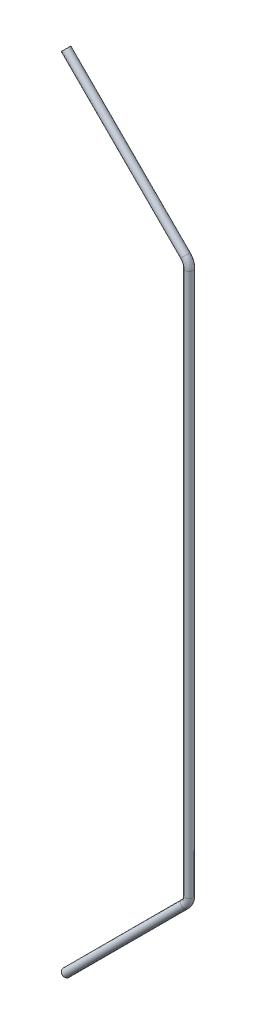
ISO-10303-21;
HEADER;
FILE_DESCRIPTION(('STEP AP214'),'2;1');
FILE_NAME('part.step','',(''),(''),'','','');
FILE_SCHEMA(('AUTOMOTIVE_DESIGN { 1 0 10303 214 1 1 1 1 }'));
ENDSEC;
DATA;
#1=APPLICATION_CONTEXT('core data for automotive mechanical design processes');
#2=APPLICATION_PROTOCOL_DEFINITION('international standard','automotive_design',2000,#1);
#3=PRODUCT_CONTEXT('',#1,'mechanical');
#4=PRODUCT('Part','Part','',(#3));
#5=PRODUCT_RELATED_PRODUCT_CATEGORY('part','',(#4));
#6=PRODUCT_DEFINITION_FORMATION('','',#4);
#7=PRODUCT_DEFINITION_CONTEXT('part definition',#1,'design');
#8=PRODUCT_DEFINITION('design','',#6,#7);
#9=PRODUCT_DEFINITION_SHAPE('','',#8);
#10=(LENGTH_UNIT() NAMED_UNIT(*) SI_UNIT(.MILLI.,.METRE.));
#11=(NAMED_UNIT(*) PLANE_ANGLE_UNIT() SI_UNIT($,.RADIAN.));
#12=(NAMED_UNIT(*) SI_UNIT($,.STERADIAN.) SOLID_ANGLE_UNIT());
#13=UNCERTAINTY_MEASURE_WITH_UNIT(LENGTH_MEASURE(1.E-05),#10,'distance_accuracy_value','');
#14=(GEOMETRIC_REPRESENTATION_CONTEXT(3) GLOBAL_UNCERTAINTY_ASSIGNED_CONTEXT((#13)) GLOBAL_UNIT_ASSIGNED_CONTEXT((#10,
#11,#12)) REPRESENTATION_CONTEXT('',''));
#15=CARTESIAN_POINT('',(0.,0.,0.));
#16=DIRECTION('',(0.,0.,1.));
#17=DIRECTION('',(1.,0.,0.));
#18=AXIS2_PLACEMENT_3D('',#15,#16,#17);
#19=CARTESIAN_POINT('',(-23026.9467766004,7669.40648306194,40306.6001960676));
#20=DIRECTION('',(0.707106781186548,-0.707106781186547,0.));
#21=DIRECTION('',(0.707106781186547,0.707106781186548,0.));
#22=AXIS2_PLACEMENT_3D('',#19,#20,#21);
#23=PLANE('',#22);
#24=CARTESIAN_POINT('',(-23026.9467766004,7669.40648306194,40306.6001960676));
#25=DIRECTION('',(0.707106781186548,-0.707106781186547,0.));
#26=DIRECTION('',(0.707106781186547,0.707106781186548,0.));
#27=AXIS2_PLACEMENT_3D('',#24,#25,#26);
#28=CIRCLE('',#27,27.0000000000004);
#29=CARTESIAN_POINT('',(-23007.8548935084,7688.49836615398,40306.6001960676));
#30=VERTEX_POINT('',#29);
#31=EDGE_CURVE('E76',#30,#30,#28,.T.);
#32=ORIENTED_EDGE('',*,*,#31,.T.);
#33=EDGE_LOOP('',(#32));
#34=FACE_BOUND('',#33,.T.);
#35=CARTESIAN_POINT('',(-23026.9467766004,7669.40648306194,40306.6001960676));
#36=DIRECTION('',(0.707106781186548,-0.707106781186547,0.));
#37=DIRECTION('',(0.707106781186547,0.707106781186548,0.));
#38=AXIS2_PLACEMENT_3D('',#35,#36,#37);
#39=CIRCLE('',#38,30.0000000000004);
#40=CARTESIAN_POINT('',(-23005.7335731648,7690.61968649754,40306.6001960676));
#41=VERTEX_POINT('',#40);
#42=EDGE_CURVE('E69',#41,#41,#39,.T.);
#43=ORIENTED_EDGE('',*,*,#42,.F.);
#44=EDGE_LOOP('',(#43));
#45=FACE_BOUND('',#44,.T.);
#46=ADVANCED_FACE('F47',(#34,#45),#23,.F.);
#47=CARTESIAN_POINT('',(-23026.9467766004,1498.91898498165,40306.6001960676));
#48=DIRECTION('',(-0.707106781186545,-0.70710678118655,0.));
#49=DIRECTION('',(0.70710678118655,-0.707106781186545,0.));
#50=AXIS2_PLACEMENT_3D('',#47,#48,#49);
#51=PLANE('',#50);
#52=CARTESIAN_POINT('',(-23026.9467766004,1498.91898498165,40306.6001960676));
#53=DIRECTION('',(-0.707106781186545,-0.70710678118655,0.));
#54=DIRECTION('',(0.70710678118655,-0.707106781186545,0.));
#55=AXIS2_PLACEMENT_3D('',#52,#53,#54);
#56=CIRCLE('',#55,27.0000000000004);
#57=CARTESIAN_POINT('',(-23007.8548935084,1479.82710188961,40306.6001960676));
#58=VERTEX_POINT('',#57);
#59=EDGE_CURVE('E72',#58,#58,#56,.T.);
#60=ORIENTED_EDGE('',*,*,#59,.F.);
#61=EDGE_LOOP('',(#60));
#62=FACE_BOUND('',#61,.T.);
#63=CARTESIAN_POINT('',(-23026.9467766004,1498.91898498165,40306.6001960676));
#64=DIRECTION('',(-0.707106781186545,-0.70710678118655,0.));
#65=DIRECTION('',(0.70710678118655,-0.707106781186545,0.));
#66=AXIS2_PLACEMENT_3D('',#63,#64,#65);
#67=CIRCLE('',#66,30.0000000000004);
#68=CARTESIAN_POINT('',(-23005.7335731648,1477.70578154605,40306.6001960676));
#69=VERTEX_POINT('',#68);
#70=EDGE_CURVE('E11',#69,#69,#67,.T.);
#71=ORIENTED_EDGE('',*,*,#70,.T.);
#72=EDGE_LOOP('',(#71));
#73=FACE_BOUND('',#72,.T.);
#74=ADVANCED_FACE('F119',(#62,#73),#51,.T.);
#75=CARTESIAN_POINT('',(-23026.9467766004,7669.40648306194,40306.6001960676));
#76=DIRECTION('',(0.707106781186546,-0.707106781186549,0.));
#77=DIRECTION('',(0.707106781186549,0.707106781186546,0.));
#78=AXIS2_PLACEMENT_3D('',#75,#76,#77);
#79=CYLINDRICAL_SURFACE('',#78,30.0000000000004);
#80=CARTESIAN_POINT('',(-22106.7356527818,6749.19535924333,40306.6001960676));
#81=DIRECTION('',(0.707106781186548,-0.707106781186547,0.));
#82=DIRECTION('',(0.707106781186547,0.707106781186548,0.));
#83=AXIS2_PLACEMENT_3D('',#80,#81,#82);
#84=CIRCLE('',#83,30.0000000000004);
#85=CARTESIAN_POINT('',(-22085.5224493462,6770.40856267895,40306.6001960676));
#86=VERTEX_POINT('',#85);
#87=EDGE_CURVE('E66',#86,#86,#84,.T.);
#88=ORIENTED_EDGE('',*,*,#87,.F.);
#89=EDGE_LOOP('',(#88));
#90=FACE_BOUND('',#89,.T.);
#91=ORIENTED_EDGE('',*,*,#42,.T.);
#92=EDGE_LOOP('',(#91));
#93=FACE_BOUND('',#92,.T.);
#94=ADVANCED_FACE('F121',(#90,#93),#79,.T.);
#95=CARTESIAN_POINT('',(-22177.4463309005,6678.48468112467,40306.6001960676));
#96=DIRECTION('',(0.,0.,-1.));
#97=DIRECTION('',(-1.,0.,0.));
#98=AXIS2_PLACEMENT_3D('',#95,#96,#97);
#99=TOROIDAL_SURFACE('',#98,100.000000000033,30.0000000000004);
#100=CARTESIAN_POINT('',(-22077.4463309005,6678.48468112467,40306.6001960676));
#101=DIRECTION('',(0.,-1.,0.));
#102=DIRECTION('',(1.,0.,0.));
#103=AXIS2_PLACEMENT_3D('',#100,#101,#102);
#104=CIRCLE('',#103,30.0000000000004);
#105=CARTESIAN_POINT('',(-22047.4463309004,6678.48468112468,40306.6001960676));
#106=VERTEX_POINT('',#105);
#107=EDGE_CURVE('E61',#106,#106,#104,.T.);
#108=CARTESIAN_POINT('',(-22177.4463309005,6678.48468112467,40306.6001960676));
#109=DIRECTION('',(0.,0.,-1.));
#110=DIRECTION('',(-1.,0.,0.));
#111=AXIS2_PLACEMENT_3D('',#108,#109,#110);
#112=CIRCLE('',#111,130.000000000034);
#113=EDGE_CURVE('',#86,#106,#112,.T.);
#114=ORIENTED_EDGE('',*,*,#87,.T.);
#115=ORIENTED_EDGE('',*,*,#107,.F.);
#116=ORIENTED_EDGE('',*,*,#113,.T.);
#117=ORIENTED_EDGE('',*,*,#113,.F.);
#118=EDGE_LOOP('',(#114,#116,#115,#117));
#119=FACE_BOUND('',#118,.T.);
#120=ADVANCED_FACE('F127',(#119),#99,.T.);
#121=CARTESIAN_POINT('',(-22077.4463309005,6678.48468112467,40306.6001960676));
#122=DIRECTION('',(0.,-1.,0.));
#123=DIRECTION('',(0.,0.,-1.));
#124=AXIS2_PLACEMENT_3D('',#121,#122,#123);
#125=CYLINDRICAL_SURFACE('',#124,30.0000000000004);
#126=CARTESIAN_POINT('',(-22077.4463309005,2489.84078691892,40306.6001960676));
#127=DIRECTION('',(0.,-1.,0.));
#128=DIRECTION('',(1.,0.,0.));
#129=AXIS2_PLACEMENT_3D('',#126,#127,#128);
#130=CIRCLE('',#129,30.0000000000004);
#131=CARTESIAN_POINT('',(-22047.4463309005,2489.84078691892,40306.6001960676));
#132=VERTEX_POINT('',#131);
#133=EDGE_CURVE('E57',#132,#132,#130,.T.);
#134=ORIENTED_EDGE('',*,*,#133,.F.);
#135=EDGE_LOOP('',(#134));
#136=FACE_BOUND('',#135,.T.);
#137=ORIENTED_EDGE('',*,*,#107,.T.);
#138=EDGE_LOOP('',(#137));
#139=FACE_BOUND('',#138,.T.);
#140=ADVANCED_FACE('F115',(#136,#139),#125,.T.);
#141=CARTESIAN_POINT('',(-22177.4463309005,2489.84078691891,40306.6001960676));
#142=DIRECTION('',(0.,0.,-1.));
#143=DIRECTION('',(-1.,0.,0.));
#144=AXIS2_PLACEMENT_3D('',#141,#142,#143);
#145=TOROIDAL_SURFACE('',#144,100.000000000005,30.0000000000004);
#146=CARTESIAN_POINT('',(-22106.7356527818,2419.13010880026,40306.6001960676));
#147=DIRECTION('',(-0.707106781186538,-0.707106781186558,0.));
#148=DIRECTION('',(0.707106781186558,-0.707106781186537,0.));
#149=AXIS2_PLACEMENT_3D('',#146,#147,#148);
#150=CIRCLE('',#149,30.0000000000004);
#151=CARTESIAN_POINT('',(-22085.5224493462,2397.91690536466,40306.6001960676));
#152=VERTEX_POINT('',#151);
#153=EDGE_CURVE('E53',#152,#152,#150,.T.);
#154=CARTESIAN_POINT('',(-22177.4463309005,2489.84078691891,40306.6001960676));
#155=DIRECTION('',(0.,0.,-1.));
#156=DIRECTION('',(-1.,0.,0.));
#157=AXIS2_PLACEMENT_3D('',#154,#155,#156);
#158=CIRCLE('',#157,130.000000000005);
#159=EDGE_CURVE('',#132,#152,#158,.T.);
#160=ORIENTED_EDGE('',*,*,#133,.T.);
#161=ORIENTED_EDGE('',*,*,#153,.F.);
#162=ORIENTED_EDGE('',*,*,#159,.T.);
#163=ORIENTED_EDGE('',*,*,#159,.F.);
#164=EDGE_LOOP('',(#160,#162,#161,#163));
#165=FACE_BOUND('',#164,.T.);
#166=ADVANCED_FACE('F109',(#165),#145,.T.);
#167=CARTESIAN_POINT('',(-22106.7356527818,2419.13010880026,40306.6001960676));
#168=DIRECTION('',(-0.707106781186546,-0.707106781186549,0.));
#169=DIRECTION('',(0.707106781186549,-0.707106781186546,0.));
#170=AXIS2_PLACEMENT_3D('',#167,#168,#169);
#171=CYLINDRICAL_SURFACE('',#170,30.0000000000004);
#172=ORIENTED_EDGE('',*,*,#70,.F.);
#173=EDGE_LOOP('',(#172));
#174=FACE_BOUND('',#173,.T.);
#175=ORIENTED_EDGE('',*,*,#153,.T.);
#176=EDGE_LOOP('',(#175));
#177=FACE_BOUND('',#176,.T.);
#178=ADVANCED_FACE('F106',(#174,#177),#171,.T.);
#179=CARTESIAN_POINT('',(-23026.9467766004,7669.40648306194,40306.6001960676));
#180=DIRECTION('',(0.707106781186546,-0.707106781186549,0.));
#181=DIRECTION('',(0.707106781186549,0.707106781186546,0.));
#182=AXIS2_PLACEMENT_3D('',#179,#180,#181);
#183=CYLINDRICAL_SURFACE('',#182,27.0000000000004);
#184=CARTESIAN_POINT('',(-22106.7356527818,6749.19535924335,40306.6001960676));
#185=DIRECTION('',(-0.707106781186566,0.707106781186529,0.));
#186=DIRECTION('',(-0.707106781186529,-0.707106781186566,0.));
#187=AXIS2_PLACEMENT_3D('',#184,#185,#186);
#188=CIRCLE('',#187,27.0000000000004);
#189=CARTESIAN_POINT('',(-22087.6437696898,6768.28724233539,40306.6001960676));
#190=VERTEX_POINT('',#189);
#191=EDGE_CURVE('E79',#190,#190,#188,.F.);
#192=ORIENTED_EDGE('',*,*,#191,.T.);
#193=EDGE_LOOP('',(#192));
#194=FACE_BOUND('',#193,.T.);
#195=ORIENTED_EDGE('',*,*,#31,.F.);
#196=EDGE_LOOP('',(#195));
#197=FACE_BOUND('',#196,.T.);
#198=ADVANCED_FACE('F91',(#194,#197),#183,.F.);
#199=CARTESIAN_POINT('',(-22177.4463309005,6678.48468112467,40306.6001960676));
#200=DIRECTION('',(0.,0.,-1.));
#201=DIRECTION('',(-1.,0.,0.));
#202=AXIS2_PLACEMENT_3D('',#199,#200,#201);
#203=TOROIDAL_SURFACE('',#202,100.000000000033,27.0000000000004);
#204=CARTESIAN_POINT('',(-22077.4463309005,6678.48468112467,40306.6001960676));
#205=DIRECTION('',(0.,-1.,0.));
#206=DIRECTION('',(0.,0.,-1.));
#207=AXIS2_PLACEMENT_3D('',#204,#205,#206);
#208=CIRCLE('',#207,27.0000000000004);
#209=CARTESIAN_POINT('',(-22050.4463309004,6678.48468112468,40306.6001960676));
#210=VERTEX_POINT('',#209);
#211=EDGE_CURVE('E85',#210,#210,#208,.T.);
#212=CARTESIAN_POINT('',(-22177.4463309005,6678.48468112467,40306.6001960676));
#213=DIRECTION('',(0.,0.,-1.));
#214=DIRECTION('',(-1.,0.,0.));
#215=AXIS2_PLACEMENT_3D('',#212,#213,#214);
#216=CIRCLE('',#215,127.000000000034);
#217=EDGE_CURVE('',#190,#210,#216,.T.);
#218=ORIENTED_EDGE('',*,*,#191,.F.);
#219=ORIENTED_EDGE('',*,*,#211,.T.);
#220=ORIENTED_EDGE('',*,*,#217,.T.);
#221=ORIENTED_EDGE('',*,*,#217,.F.);
#222=EDGE_LOOP('',(#218,#220,#219,#221));
#223=FACE_BOUND('',#222,.T.);
#224=ADVANCED_FACE('F94',(#223),#203,.F.);
#225=CARTESIAN_POINT('',(-22077.4463309005,6678.48468112467,40306.6001960676));
#226=DIRECTION('',(0.,-1.,0.));
#227=DIRECTION('',(0.,0.,-1.));
#228=AXIS2_PLACEMENT_3D('',#225,#226,#227);
#229=CYLINDRICAL_SURFACE('',#228,27.0000000000004);
#230=CARTESIAN_POINT('',(-22077.4463309005,2489.84078691892,40306.6001960676));
#231=DIRECTION('',(0.,1.,0.));
#232=DIRECTION('',(-1.,0.,0.));
#233=AXIS2_PLACEMENT_3D('',#230,#231,#232);
#234=CIRCLE('',#233,27.0000000000004);
#235=CARTESIAN_POINT('',(-22050.4463309005,2489.84078691892,40306.6001960676));
#236=VERTEX_POINT('',#235);
#237=EDGE_CURVE('E82',#236,#236,#234,.F.);
#238=ORIENTED_EDGE('',*,*,#237,.T.);
#239=EDGE_LOOP('',(#238));
#240=FACE_BOUND('',#239,.T.);
#241=ORIENTED_EDGE('',*,*,#211,.F.);
#242=EDGE_LOOP('',(#241));
#243=FACE_BOUND('',#242,.T.);
#244=ADVANCED_FACE('F96',(#240,#243),#229,.F.);
#245=CARTESIAN_POINT('',(-22177.4463309005,2489.84078691891,40306.6001960676));
#246=DIRECTION('',(0.,0.,-1.));
#247=DIRECTION('',(-1.,0.,0.));
#248=AXIS2_PLACEMENT_3D('',#245,#246,#247);
#249=TOROIDAL_SURFACE('',#248,100.000000000005,27.0000000000004);
#250=CARTESIAN_POINT('',(-22106.7356527818,2419.13010880026,40306.6001960676));
#251=DIRECTION('',(-0.707106781186546,-0.707106781186549,0.));
#252=DIRECTION('',(0.707106781186549,-0.707106781186546,0.));
#253=AXIS2_PLACEMENT_3D('',#250,#251,#252);
#254=CIRCLE('',#253,27.0000000000004);
#255=CARTESIAN_POINT('',(-22087.6437696898,2400.03822570822,40306.6001960676));
#256=VERTEX_POINT('',#255);
#257=EDGE_CURVE('E75',#256,#256,#254,.T.);
#258=CARTESIAN_POINT('',(-22177.4463309005,2489.84078691891,40306.6001960676));
#259=DIRECTION('',(0.,0.,-1.));
#260=DIRECTION('',(-1.,0.,0.));
#261=AXIS2_PLACEMENT_3D('',#258,#259,#260);
#262=CIRCLE('',#261,127.000000000005);
#263=EDGE_CURVE('',#236,#256,#262,.T.);
#264=ORIENTED_EDGE('',*,*,#237,.F.);
#265=ORIENTED_EDGE('',*,*,#257,.T.);
#266=ORIENTED_EDGE('',*,*,#263,.T.);
#267=ORIENTED_EDGE('',*,*,#263,.F.);
#268=EDGE_LOOP('',(#264,#266,#265,#267));
#269=FACE_BOUND('',#268,.T.);
#270=ADVANCED_FACE('F103',(#269),#249,.F.);
#271=CARTESIAN_POINT('',(-22106.7356527818,2419.13010880026,40306.6001960676));
#272=DIRECTION('',(-0.707106781186546,-0.707106781186549,0.));
#273=DIRECTION('',(0.707106781186549,-0.707106781186546,0.));
#274=AXIS2_PLACEMENT_3D('',#271,#272,#273);
#275=CYLINDRICAL_SURFACE('',#274,27.0000000000004);
#276=ORIENTED_EDGE('',*,*,#59,.T.);
#277=EDGE_LOOP('',(#276));
#278=FACE_BOUND('',#277,.T.);
#279=ORIENTED_EDGE('',*,*,#257,.F.);
#280=EDGE_LOOP('',(#279));
#281=FACE_BOUND('',#280,.T.);
#282=ADVANCED_FACE('F131',(#278,#281),#275,.F.);
#283=CLOSED_SHELL('',(#46,#74,#94,#120,#140,#166,#178,#198,#224,#244,#270,#282));
#284=MANIFOLD_SOLID_BREP('B2',#283);
#285=ADVANCED_BREP_SHAPE_REPRESENTATION('',(#18,#284),#14);
#286=SHAPE_DEFINITION_REPRESENTATION(#9,#285);
ENDSEC;
END-ISO-10303-21;
